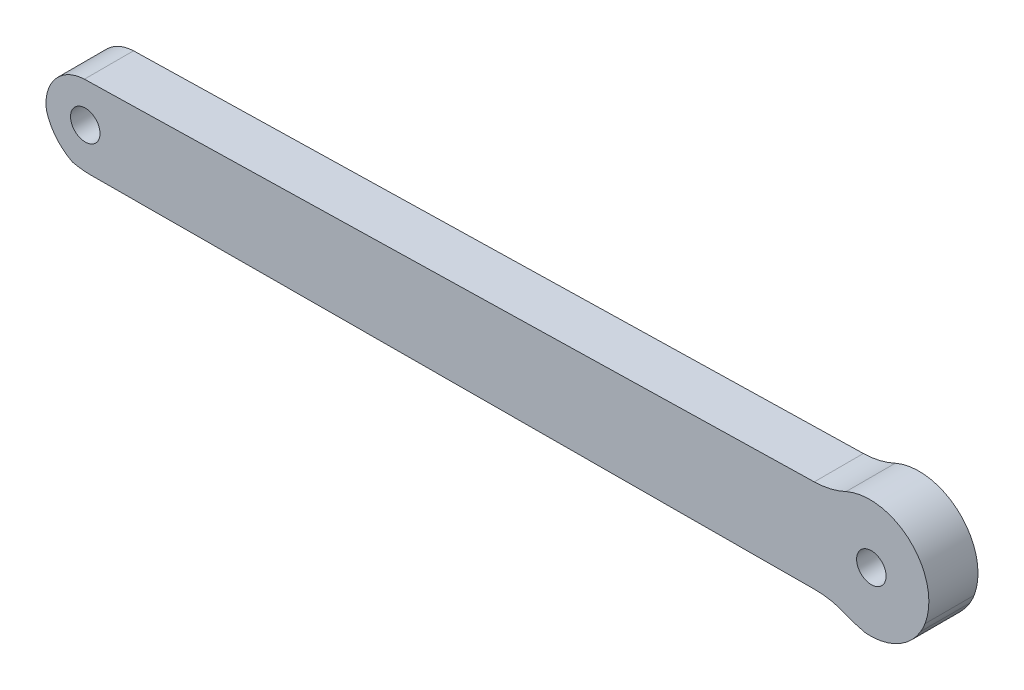
ISO-10303-21;
HEADER;
FILE_DESCRIPTION(('STEP AP214'),'2;1');
FILE_NAME('part.step','',(''),(''),'','','');
FILE_SCHEMA(('AUTOMOTIVE_DESIGN { 1 0 10303 214 1 1 1 1 }'));
ENDSEC;
DATA;
#1=APPLICATION_CONTEXT('core data for automotive mechanical design processes');
#2=APPLICATION_PROTOCOL_DEFINITION('international standard','automotive_design',2000,#1);
#3=PRODUCT_CONTEXT('',#1,'mechanical');
#4=PRODUCT('Part','Part','',(#3));
#5=PRODUCT_RELATED_PRODUCT_CATEGORY('part','',(#4));
#6=PRODUCT_DEFINITION_FORMATION('','',#4);
#7=PRODUCT_DEFINITION_CONTEXT('part definition',#1,'design');
#8=PRODUCT_DEFINITION('design','',#6,#7);
#9=PRODUCT_DEFINITION_SHAPE('','',#8);
#10=(LENGTH_UNIT() NAMED_UNIT(*) SI_UNIT(.MILLI.,.METRE.));
#11=(NAMED_UNIT(*) PLANE_ANGLE_UNIT() SI_UNIT($,.RADIAN.));
#12=(NAMED_UNIT(*) SI_UNIT($,.STERADIAN.) SOLID_ANGLE_UNIT());
#13=UNCERTAINTY_MEASURE_WITH_UNIT(LENGTH_MEASURE(1.E-05),#10,'distance_accuracy_value','');
#14=(GEOMETRIC_REPRESENTATION_CONTEXT(3) GLOBAL_UNCERTAINTY_ASSIGNED_CONTEXT((#13)) GLOBAL_UNIT_ASSIGNED_CONTEXT((#10,
#11,#12)) REPRESENTATION_CONTEXT('',''));
#15=CARTESIAN_POINT('',(0.,0.,0.));
#16=DIRECTION('',(0.,0.,1.));
#17=DIRECTION('',(1.,0.,0.));
#18=AXIS2_PLACEMENT_3D('',#15,#16,#17);
#19=CARTESIAN_POINT('',(2248.87555161224,1643.81417646837,5.));
#20=DIRECTION('',(0.,0.,1.));
#21=DIRECTION('',(1.,0.,0.));
#22=AXIS2_PLACEMENT_3D('',#19,#20,#21);
#23=PLANE('',#22);
#24=CARTESIAN_POINT('',(2168.21802948282,1642.92504021071,5.));
#25=DIRECTION('',(0.,0.,1.));
#26=DIRECTION('',(1.,0.,0.));
#27=AXIS2_PLACEMENT_3D('',#24,#25,#26);
#28=CIRCLE('',#27,1.50000000000011);
#29=CARTESIAN_POINT('',(2169.71802948282,1642.92504021071,5.));
#30=VERTEX_POINT('',#29);
#31=EDGE_CURVE('E176',#30,#30,#28,.T.);
#32=ORIENTED_EDGE('',*,*,#31,.F.);
#33=EDGE_LOOP('',(#32));
#34=FACE_BOUND('',#33,.T.);
#35=CARTESIAN_POINT('',(2248.87555161224,1643.81417646837,5.));
#36=DIRECTION('',(0.,0.,1.));
#37=DIRECTION('',(1.,0.,0.));
#38=AXIS2_PLACEMENT_3D('',#35,#36,#37);
#39=CIRCLE('',#38,6.07841978224706);
#40=CARTESIAN_POINT('',(2246.9678258357,1638.04288810175,5.));
#41=VERTEX_POINT('',#40);
#42=CARTESIAN_POINT('',(2247.65376621177,1637.85981441317,5.));
#43=VERTEX_POINT('',#42);
#44=EDGE_CURVE('E209',#41,#43,#39,.T.);
#45=ORIENTED_EDGE('',*,*,#44,.T.);
#46=CARTESIAN_POINT('',(2248.06658296509,1643.84586658425,5.));
#47=DIRECTION('',(0.,0.,1.));
#48=DIRECTION('',(1.,0.,0.));
#49=AXIS2_PLACEMENT_3D('',#46,#47,#48);
#50=CIRCLE('',#49,6.00026984948569);
#51=CARTESIAN_POINT('',(2253.23883895751,1640.80431990279,5.));
#52=VERTEX_POINT('',#51);
#53=EDGE_CURVE('E115',#43,#52,#50,.T.);
#54=ORIENTED_EDGE('',*,*,#53,.T.);
#55=CARTESIAN_POINT('',(2248.16682165628,1643.79766107637,5.));
#56=DIRECTION('',(0.,0.,1.));
#57=DIRECTION('',(1.,0.,0.));
#58=AXIS2_PLACEMENT_3D('',#55,#56,#57);
#59=CIRCLE('',#58,5.88943553198723);
#60=CARTESIAN_POINT('',(2253.67173298523,1641.70448116393,5.));
#61=VERTEX_POINT('',#60);
#62=EDGE_CURVE('E250',#52,#61,#59,.T.);
#63=ORIENTED_EDGE('',*,*,#62,.T.);
#64=CARTESIAN_POINT('',(2248.06658296509,1643.84586658425,5.));
#65=DIRECTION('',(0.,0.,1.));
#66=DIRECTION('',(1.,0.,0.));
#67=AXIS2_PLACEMENT_3D('',#64,#65,#66);
#68=CIRCLE('',#67,6.00026984948538);
#69=CARTESIAN_POINT('',(2245.64694396341,1649.33663933207,5.));
#70=VERTEX_POINT('',#69);
#71=EDGE_CURVE('E270',#61,#70,#68,.T.);
#72=ORIENTED_EDGE('',*,*,#71,.T.);
#73=CARTESIAN_POINT('',(2242.22674561174,1656.56911460103,5.));
#74=DIRECTION('',(0.,0.,-1.));
#75=DIRECTION('',(1.,0.,0.));
#76=AXIS2_PLACEMENT_3D('',#73,#74,#75);
#77=CIRCLE('',#76,8.00040344487991);
#78=CARTESIAN_POINT('',(2242.40432399022,1648.57068217959,5.));
#79=VERTEX_POINT('',#78);
#80=EDGE_CURVE('E266',#70,#79,#77,.T.);
#81=ORIENTED_EDGE('',*,*,#80,.T.);
#82=DIRECTION('',(-0.999754351339683,-0.0221638664806084,0.));
#83=VECTOR('',#82,1.);
#84=CARTESIAN_POINT('',(2242.40432399022,1648.57068217959,5.));
#85=LINE('',#84,#83);
#86=CARTESIAN_POINT('',(2168.12937401527,1646.92405761437,5.));
#87=VERTEX_POINT('',#86);
#88=EDGE_CURVE('E269',#79,#87,#85,.T.);
#89=ORIENTED_EDGE('',*,*,#88,.T.);
#90=CARTESIAN_POINT('',(2168.2985753185,1642.84723381647,5.));
#91=DIRECTION('',(0.,0.,1.));
#92=DIRECTION('',(1.,0.,0.));
#93=AXIS2_PLACEMENT_3D('',#90,#91,#92);
#94=CIRCLE('',#93,4.08033348639338);
#95=CARTESIAN_POINT('',(2164.26519110807,1642.2300359785,5.));
#96=VERTEX_POINT('',#95);
#97=EDGE_CURVE('E274',#87,#96,#94,.T.);
#98=ORIENTED_EDGE('',*,*,#97,.T.);
#99=CARTESIAN_POINT('',(2169.24904852874,1643.63290763037,5.));
#100=DIRECTION('',(0.,0.,1.));
#101=DIRECTION('',(1.,0.,0.));
#102=AXIS2_PLACEMENT_3D('',#99,#100,#101);
#103=CIRCLE('',#102,5.17753644711653);
#104=CARTESIAN_POINT('',(2166.93352039616,1639.00200997133,5.));
#105=VERTEX_POINT('',#104);
#106=EDGE_CURVE('E281',#96,#105,#103,.T.);
#107=ORIENTED_EDGE('',*,*,#106,.T.);
#108=CARTESIAN_POINT('',(2168.74214317514,1646.79552491601,5.));
#109=DIRECTION('',(0.,0.,1.));
#110=DIRECTION('',(1.,0.,0.));
#111=AXIS2_PLACEMENT_3D('',#108,#109,#110);
#112=CIRCLE('',#111,8.00062444747545);
#113=CARTESIAN_POINT('',(2168.77639322868,1638.79497377978,5.));
#114=VERTEX_POINT('',#113);
#115=EDGE_CURVE('E284',#105,#114,#112,.T.);
#116=ORIENTED_EDGE('',*,*,#115,.T.);
#117=DIRECTION('',(0.999990723069276,0.00430740935921032,0.));
#118=VECTOR('',#117,1.);
#119=CARTESIAN_POINT('',(2168.77639322868,1638.79497377978,5.));
#120=LINE('',#119,#118);
#121=CARTESIAN_POINT('',(2186.87080709587,1638.87291455048,5.));
#122=VERTEX_POINT('',#121);
#123=EDGE_CURVE('E149',#114,#122,#120,.T.);
#124=ORIENTED_EDGE('',*,*,#123,.T.);
#125=DIRECTION('',(0.99999074479343,0.00430236301141635,0.));
#126=VECTOR('',#125,1.);
#127=CARTESIAN_POINT('',(2186.87080709587,1638.87291455048,5.));
#128=LINE('',#127,#126);
#129=CARTESIAN_POINT('',(2242.52108602034,1639.11234446807,5.));
#130=VERTEX_POINT('',#129);
#131=EDGE_CURVE('E143',#122,#130,#128,.T.);
#132=ORIENTED_EDGE('',*,*,#131,.T.);
#133=CARTESIAN_POINT('',(2242.54158007553,1631.11407424039,5.));
#134=DIRECTION('',(0.,0.,-1.));
#135=DIRECTION('',(1.,0.,0.));
#136=AXIS2_PLACEMENT_3D('',#133,#134,#135);
#137=CIRCLE('',#136,7.99829648371076);
#138=CARTESIAN_POINT('',(2245.78158251303,1638.4267434416,5.));
#139=VERTEX_POINT('',#138);
#140=EDGE_CURVE('E147',#130,#139,#137,.T.);
#141=ORIENTED_EDGE('',*,*,#140,.T.);
#142=CARTESIAN_POINT('',(2248.21194548244,1643.91251517453,5.));
#143=DIRECTION('',(0.,0.,1.));
#144=DIRECTION('',(1.,0.,0.));
#145=AXIS2_PLACEMENT_3D('',#142,#143,#144);
#146=CIRCLE('',#145,6.00002963900537);
#147=EDGE_CURVE('E57',#139,#41,#146,.T.);
#148=ORIENTED_EDGE('',*,*,#147,.T.);
#149=EDGE_LOOP('',(#45,#54,#63,#72,#81,#89,#98,#107,#116,#124,#132,#141,#148));
#150=FACE_BOUND('',#149,.T.);
#151=CARTESIAN_POINT('',(2248.21189269629,1643.91255609579,5.));
#152=DIRECTION('',(0.,0.,1.));
#153=DIRECTION('',(1.,0.,0.));
#154=AXIS2_PLACEMENT_3D('',#151,#152,#153);
#155=CIRCLE('',#154,1.50000000000011);
#156=CARTESIAN_POINT('',(2249.71189269629,1643.91255609579,5.));
#157=VERTEX_POINT('',#156);
#158=EDGE_CURVE('E328',#157,#157,#155,.T.);
#159=ORIENTED_EDGE('',*,*,#158,.F.);
#160=EDGE_LOOP('',(#159));
#161=FACE_BOUND('',#160,.T.);
#162=ADVANCED_FACE('F39',(#34,#150,#161),#23,.T.);
#163=CARTESIAN_POINT('',(2248.87555161224,1643.81417646837,0.));
#164=DIRECTION('',(0.,0.,1.));
#165=DIRECTION('',(1.,0.,0.));
#166=AXIS2_PLACEMENT_3D('',#163,#164,#165);
#167=PLANE('',#166);
#168=CARTESIAN_POINT('',(2248.87555161224,1643.81417646837,0.));
#169=DIRECTION('',(0.,0.,1.));
#170=DIRECTION('',(1.,0.,0.));
#171=AXIS2_PLACEMENT_3D('',#168,#169,#170);
#172=CIRCLE('',#171,6.07841978224706);
#173=CARTESIAN_POINT('',(2246.9678258357,1638.04288810175,0.));
#174=VERTEX_POINT('',#173);
#175=CARTESIAN_POINT('',(2247.65376621177,1637.85981441317,0.));
#176=VERTEX_POINT('',#175);
#177=EDGE_CURVE('E171',#174,#176,#172,.T.);
#178=ORIENTED_EDGE('',*,*,#177,.F.);
#179=CARTESIAN_POINT('',(2248.21194548244,1643.91251517453,0.));
#180=DIRECTION('',(0.,0.,1.));
#181=DIRECTION('',(1.,0.,0.));
#182=AXIS2_PLACEMENT_3D('',#179,#180,#181);
#183=CIRCLE('',#182,6.00002963900537);
#184=CARTESIAN_POINT('',(2245.78158251303,1638.4267434416,0.));
#185=VERTEX_POINT('',#184);
#186=EDGE_CURVE('E107',#185,#174,#183,.T.);
#187=ORIENTED_EDGE('',*,*,#186,.F.);
#188=CARTESIAN_POINT('',(2242.54158007553,1631.11407424039,0.));
#189=DIRECTION('',(0.,0.,-1.));
#190=DIRECTION('',(1.,0.,0.));
#191=AXIS2_PLACEMENT_3D('',#188,#189,#190);
#192=CIRCLE('',#191,7.99829648371076);
#193=CARTESIAN_POINT('',(2242.52108602034,1639.11234446807,0.));
#194=VERTEX_POINT('',#193);
#195=EDGE_CURVE('E101',#194,#185,#192,.T.);
#196=ORIENTED_EDGE('',*,*,#195,.F.);
#197=DIRECTION('',(0.99999074479343,0.00430236301141635,0.));
#198=VECTOR('',#197,1.);
#199=CARTESIAN_POINT('',(2186.87080709587,1638.87291455048,0.));
#200=LINE('',#199,#198);
#201=CARTESIAN_POINT('',(2186.87080709587,1638.87291455048,0.));
#202=VERTEX_POINT('',#201);
#203=EDGE_CURVE('E158',#202,#194,#200,.T.);
#204=ORIENTED_EDGE('',*,*,#203,.F.);
#205=DIRECTION('',(0.999990723069276,0.00430740935921032,0.));
#206=VECTOR('',#205,1.);
#207=CARTESIAN_POINT('',(2168.77639322868,1638.79497377978,0.));
#208=LINE('',#207,#206);
#209=CARTESIAN_POINT('',(2168.77639322868,1638.79497377978,0.));
#210=VERTEX_POINT('',#209);
#211=EDGE_CURVE('E200',#210,#202,#208,.T.);
#212=ORIENTED_EDGE('',*,*,#211,.F.);
#213=CARTESIAN_POINT('',(2168.74214317514,1646.79552491601,0.));
#214=DIRECTION('',(0.,0.,1.));
#215=DIRECTION('',(1.,0.,0.));
#216=AXIS2_PLACEMENT_3D('',#213,#214,#215);
#217=CIRCLE('',#216,8.00062444747545);
#218=CARTESIAN_POINT('',(2166.93352039616,1639.00200997133,0.));
#219=VERTEX_POINT('',#218);
#220=EDGE_CURVE('E197',#219,#210,#217,.T.);
#221=ORIENTED_EDGE('',*,*,#220,.F.);
#222=CARTESIAN_POINT('',(2169.24904852874,1643.63290763037,0.));
#223=DIRECTION('',(0.,0.,1.));
#224=DIRECTION('',(1.,0.,0.));
#225=AXIS2_PLACEMENT_3D('',#222,#223,#224);
#226=CIRCLE('',#225,5.17753644711653);
#227=CARTESIAN_POINT('',(2164.26519110807,1642.2300359785,0.));
#228=VERTEX_POINT('',#227);
#229=EDGE_CURVE('E194',#228,#219,#226,.T.);
#230=ORIENTED_EDGE('',*,*,#229,.F.);
#231=CARTESIAN_POINT('',(2168.2985753185,1642.84723381647,0.));
#232=DIRECTION('',(0.,0.,1.));
#233=DIRECTION('',(1.,0.,0.));
#234=AXIS2_PLACEMENT_3D('',#231,#232,#233);
#235=CIRCLE('',#234,4.08033348639338);
#236=CARTESIAN_POINT('',(2168.12937401527,1646.92405761437,0.));
#237=VERTEX_POINT('',#236);
#238=EDGE_CURVE('E191',#237,#228,#235,.T.);
#239=ORIENTED_EDGE('',*,*,#238,.F.);
#240=DIRECTION('',(-0.999754351339683,-0.0221638664806084,0.));
#241=VECTOR('',#240,1.);
#242=CARTESIAN_POINT('',(2242.40432399022,1648.57068217959,0.));
#243=LINE('',#242,#241);
#244=CARTESIAN_POINT('',(2242.40432399022,1648.57068217959,0.));
#245=VERTEX_POINT('',#244);
#246=EDGE_CURVE('E188',#245,#237,#243,.T.);
#247=ORIENTED_EDGE('',*,*,#246,.F.);
#248=CARTESIAN_POINT('',(2242.22674561174,1656.56911460103,0.));
#249=DIRECTION('',(0.,0.,-1.));
#250=DIRECTION('',(1.,0.,0.));
#251=AXIS2_PLACEMENT_3D('',#248,#249,#250);
#252=CIRCLE('',#251,8.00040344487991);
#253=CARTESIAN_POINT('',(2245.64694396341,1649.33663933207,0.));
#254=VERTEX_POINT('',#253);
#255=EDGE_CURVE('E185',#254,#245,#252,.T.);
#256=ORIENTED_EDGE('',*,*,#255,.F.);
#257=CARTESIAN_POINT('',(2248.06658296509,1643.84586658425,0.));
#258=DIRECTION('',(0.,0.,1.));
#259=DIRECTION('',(1.,0.,0.));
#260=AXIS2_PLACEMENT_3D('',#257,#258,#259);
#261=CIRCLE('',#260,6.00026984948538);
#262=CARTESIAN_POINT('',(2253.67173298523,1641.70448116393,0.));
#263=VERTEX_POINT('',#262);
#264=EDGE_CURVE('E182',#263,#254,#261,.T.);
#265=ORIENTED_EDGE('',*,*,#264,.F.);
#266=CARTESIAN_POINT('',(2248.16682165628,1643.79766107637,0.));
#267=DIRECTION('',(0.,0.,1.));
#268=DIRECTION('',(1.,0.,0.));
#269=AXIS2_PLACEMENT_3D('',#266,#267,#268);
#270=CIRCLE('',#269,5.88943553198723);
#271=CARTESIAN_POINT('',(2253.23883895751,1640.80431990279,0.));
#272=VERTEX_POINT('',#271);
#273=EDGE_CURVE('E179',#272,#263,#270,.T.);
#274=ORIENTED_EDGE('',*,*,#273,.F.);
#275=CARTESIAN_POINT('',(2248.06658296509,1643.84586658425,0.));
#276=DIRECTION('',(0.,0.,1.));
#277=DIRECTION('',(1.,0.,0.));
#278=AXIS2_PLACEMENT_3D('',#275,#276,#277);
#279=CIRCLE('',#278,6.00026984948569);
#280=EDGE_CURVE('E175',#176,#272,#279,.T.);
#281=ORIENTED_EDGE('',*,*,#280,.F.);
#282=EDGE_LOOP('',(#178,#187,#196,#204,#212,#221,#230,#239,#247,#256,#265,#274,#281));
#283=FACE_BOUND('',#282,.T.);
#284=CARTESIAN_POINT('',(2168.21802948282,1642.92504021071,0.));
#285=DIRECTION('',(0.,0.,1.));
#286=DIRECTION('',(1.,0.,0.));
#287=AXIS2_PLACEMENT_3D('',#284,#285,#286);
#288=CIRCLE('',#287,1.50000000000011);
#289=CARTESIAN_POINT('',(2169.71802948282,1642.92504021071,0.));
#290=VERTEX_POINT('',#289);
#291=EDGE_CURVE('E336',#290,#290,#288,.T.);
#292=ORIENTED_EDGE('',*,*,#291,.T.);
#293=EDGE_LOOP('',(#292));
#294=FACE_BOUND('',#293,.T.);
#295=CARTESIAN_POINT('',(2248.21189269629,1643.91255609579,0.));
#296=DIRECTION('',(0.,0.,1.));
#297=DIRECTION('',(1.,0.,0.));
#298=AXIS2_PLACEMENT_3D('',#295,#296,#297);
#299=CIRCLE('',#298,1.50000000000011);
#300=CARTESIAN_POINT('',(2249.71189269629,1643.91255609579,0.));
#301=VERTEX_POINT('',#300);
#302=EDGE_CURVE('E331',#301,#301,#299,.T.);
#303=ORIENTED_EDGE('',*,*,#302,.T.);
#304=EDGE_LOOP('',(#303));
#305=FACE_BOUND('',#304,.T.);
#306=ADVANCED_FACE('F254',(#283,#294,#305),#167,.F.);
#307=CARTESIAN_POINT('',(2248.87555161224,1643.81417646837,5.));
#308=DIRECTION('',(0.,0.,-1.));
#309=DIRECTION('',(-1.,0.,0.));
#310=AXIS2_PLACEMENT_3D('',#307,#308,#309);
#311=CYLINDRICAL_SURFACE('',#310,6.07841978224706);
#312=ORIENTED_EDGE('',*,*,#177,.T.);
#313=DIRECTION('',(0.,0.,-1.));
#314=VECTOR('',#313,1.);
#315=CARTESIAN_POINT('',(2247.65376621177,1637.85981441317,5.));
#316=LINE('',#315,#314);
#317=EDGE_CURVE('E11',#43,#176,#316,.T.);
#318=ORIENTED_EDGE('',*,*,#317,.F.);
#319=ORIENTED_EDGE('',*,*,#44,.F.);
#320=DIRECTION('',(0.,0.,-1.));
#321=VECTOR('',#320,1.);
#322=CARTESIAN_POINT('',(2246.9678258357,1638.04288810175,5.));
#323=LINE('',#322,#321);
#324=EDGE_CURVE('E167',#41,#174,#323,.T.);
#325=ORIENTED_EDGE('',*,*,#324,.T.);
#326=EDGE_LOOP('',(#312,#318,#319,#325));
#327=FACE_BOUND('',#326,.T.);
#328=ADVANCED_FACE('F41',(#327),#311,.T.);
#329=CARTESIAN_POINT('',(2248.06658296509,1643.84586658425,5.));
#330=DIRECTION('',(0.,0.,-1.));
#331=DIRECTION('',(-1.,0.,0.));
#332=AXIS2_PLACEMENT_3D('',#329,#330,#331);
#333=CYLINDRICAL_SURFACE('',#332,6.00026984948569);
#334=ORIENTED_EDGE('',*,*,#280,.T.);
#335=DIRECTION('',(0.,0.,-1.));
#336=VECTOR('',#335,1.);
#337=CARTESIAN_POINT('',(2253.23883895751,1640.80431990279,5.));
#338=LINE('',#337,#336);
#339=EDGE_CURVE('E49',#52,#272,#338,.T.);
#340=ORIENTED_EDGE('',*,*,#339,.F.);
#341=ORIENTED_EDGE('',*,*,#53,.F.);
#342=ORIENTED_EDGE('',*,*,#317,.T.);
#343=EDGE_LOOP('',(#334,#340,#341,#342));
#344=FACE_BOUND('',#343,.T.);
#345=ADVANCED_FACE('F444',(#344),#333,.T.);
#346=CARTESIAN_POINT('',(2248.16682165628,1643.79766107637,5.));
#347=DIRECTION('',(0.,0.,-1.));
#348=DIRECTION('',(-1.,0.,0.));
#349=AXIS2_PLACEMENT_3D('',#346,#347,#348);
#350=CYLINDRICAL_SURFACE('',#349,5.88943553198723);
#351=ORIENTED_EDGE('',*,*,#273,.T.);
#352=DIRECTION('',(0.,0.,-1.));
#353=VECTOR('',#352,1.);
#354=CARTESIAN_POINT('',(2253.67173298523,1641.70448116393,5.));
#355=LINE('',#354,#353);
#356=EDGE_CURVE('E240',#61,#263,#355,.T.);
#357=ORIENTED_EDGE('',*,*,#356,.F.);
#358=ORIENTED_EDGE('',*,*,#62,.F.);
#359=ORIENTED_EDGE('',*,*,#339,.T.);
#360=EDGE_LOOP('',(#351,#357,#358,#359));
#361=FACE_BOUND('',#360,.T.);
#362=ADVANCED_FACE('F248',(#361),#350,.T.);
#363=CARTESIAN_POINT('',(2248.06658296509,1643.84586658425,5.));
#364=DIRECTION('',(0.,0.,-1.));
#365=DIRECTION('',(-1.,0.,0.));
#366=AXIS2_PLACEMENT_3D('',#363,#364,#365);
#367=CYLINDRICAL_SURFACE('',#366,6.00026984948538);
#368=ORIENTED_EDGE('',*,*,#264,.T.);
#369=DIRECTION('',(0.,0.,-1.));
#370=VECTOR('',#369,1.);
#371=CARTESIAN_POINT('',(2245.64694396341,1649.33663933207,5.));
#372=LINE('',#371,#370);
#373=EDGE_CURVE('E236',#70,#254,#372,.T.);
#374=ORIENTED_EDGE('',*,*,#373,.F.);
#375=ORIENTED_EDGE('',*,*,#71,.F.);
#376=ORIENTED_EDGE('',*,*,#356,.T.);
#377=EDGE_LOOP('',(#368,#374,#375,#376));
#378=FACE_BOUND('',#377,.T.);
#379=ADVANCED_FACE('F260',(#378),#367,.T.);
#380=CARTESIAN_POINT('',(2242.22674561174,1656.56911460103,5.));
#381=DIRECTION('',(0.,0.,-1.));
#382=DIRECTION('',(-1.,0.,0.));
#383=AXIS2_PLACEMENT_3D('',#380,#381,#382);
#384=CYLINDRICAL_SURFACE('',#383,8.00040344487991);
#385=ORIENTED_EDGE('',*,*,#255,.T.);
#386=DIRECTION('',(0.,0.,-1.));
#387=VECTOR('',#386,1.);
#388=CARTESIAN_POINT('',(2242.40432399022,1648.57068217959,5.));
#389=LINE('',#388,#387);
#390=EDGE_CURVE('E232',#79,#245,#389,.T.);
#391=ORIENTED_EDGE('',*,*,#390,.F.);
#392=ORIENTED_EDGE('',*,*,#80,.F.);
#393=ORIENTED_EDGE('',*,*,#373,.T.);
#394=EDGE_LOOP('',(#385,#391,#392,#393));
#395=FACE_BOUND('',#394,.T.);
#396=ADVANCED_FACE('F264',(#395),#384,.F.);
#397=CARTESIAN_POINT('',(2242.40432399022,1648.57068217959,5.));
#398=DIRECTION('',(0.0221638664806084,-0.999754351339683,0.));
#399=DIRECTION('',(0.999754351339683,0.0221638664806084,0.));
#400=AXIS2_PLACEMENT_3D('',#397,#398,#399);
#401=PLANE('',#400);
#402=ORIENTED_EDGE('',*,*,#246,.T.);
#403=DIRECTION('',(0.,0.,-1.));
#404=VECTOR('',#403,1.);
#405=CARTESIAN_POINT('',(2168.12937401527,1646.92405761437,5.));
#406=LINE('',#405,#404);
#407=EDGE_CURVE('E228',#87,#237,#406,.T.);
#408=ORIENTED_EDGE('',*,*,#407,.F.);
#409=ORIENTED_EDGE('',*,*,#88,.F.);
#410=ORIENTED_EDGE('',*,*,#390,.T.);
#411=EDGE_LOOP('',(#402,#408,#409,#410));
#412=FACE_BOUND('',#411,.T.);
#413=ADVANCED_FACE('F409',(#412),#401,.F.);
#414=CARTESIAN_POINT('',(2168.2985753185,1642.84723381647,5.));
#415=DIRECTION('',(0.,0.,-1.));
#416=DIRECTION('',(-1.,0.,0.));
#417=AXIS2_PLACEMENT_3D('',#414,#415,#416);
#418=CYLINDRICAL_SURFACE('',#417,4.08033348639338);
#419=ORIENTED_EDGE('',*,*,#238,.T.);
#420=DIRECTION('',(0.,0.,-1.));
#421=VECTOR('',#420,1.);
#422=CARTESIAN_POINT('',(2164.26519110807,1642.2300359785,5.));
#423=LINE('',#422,#421);
#424=EDGE_CURVE('E224',#96,#228,#423,.T.);
#425=ORIENTED_EDGE('',*,*,#424,.F.);
#426=ORIENTED_EDGE('',*,*,#97,.F.);
#427=ORIENTED_EDGE('',*,*,#407,.T.);
#428=EDGE_LOOP('',(#419,#425,#426,#427));
#429=FACE_BOUND('',#428,.T.);
#430=ADVANCED_FACE('F399',(#429),#418,.T.);
#431=CARTESIAN_POINT('',(2169.24904852874,1643.63290763037,5.));
#432=DIRECTION('',(0.,0.,-1.));
#433=DIRECTION('',(-1.,0.,0.));
#434=AXIS2_PLACEMENT_3D('',#431,#432,#433);
#435=CYLINDRICAL_SURFACE('',#434,5.17753644711653);
#436=ORIENTED_EDGE('',*,*,#229,.T.);
#437=DIRECTION('',(0.,0.,-1.));
#438=VECTOR('',#437,1.);
#439=CARTESIAN_POINT('',(2166.93352039616,1639.00200997133,5.));
#440=LINE('',#439,#438);
#441=EDGE_CURVE('E220',#105,#219,#440,.T.);
#442=ORIENTED_EDGE('',*,*,#441,.F.);
#443=ORIENTED_EDGE('',*,*,#106,.F.);
#444=ORIENTED_EDGE('',*,*,#424,.T.);
#445=EDGE_LOOP('',(#436,#442,#443,#444));
#446=FACE_BOUND('',#445,.T.);
#447=ADVANCED_FACE('F390',(#446),#435,.T.);
#448=CARTESIAN_POINT('',(2168.74214317514,1646.79552491601,5.));
#449=DIRECTION('',(0.,0.,-1.));
#450=DIRECTION('',(-1.,0.,0.));
#451=AXIS2_PLACEMENT_3D('',#448,#449,#450);
#452=CYLINDRICAL_SURFACE('',#451,8.00062444747545);
#453=ORIENTED_EDGE('',*,*,#220,.T.);
#454=DIRECTION('',(0.,0.,-1.));
#455=VECTOR('',#454,1.);
#456=CARTESIAN_POINT('',(2168.77639322868,1638.79497377978,5.));
#457=LINE('',#456,#455);
#458=EDGE_CURVE('E216',#114,#210,#457,.T.);
#459=ORIENTED_EDGE('',*,*,#458,.F.);
#460=ORIENTED_EDGE('',*,*,#115,.F.);
#461=ORIENTED_EDGE('',*,*,#441,.T.);
#462=EDGE_LOOP('',(#453,#459,#460,#461));
#463=FACE_BOUND('',#462,.T.);
#464=ADVANCED_FACE('F292',(#463),#452,.T.);
#465=CARTESIAN_POINT('',(2168.77639322868,1638.79497377978,5.));
#466=DIRECTION('',(-0.00430740935921032,0.999990723069275,0.));
#467=DIRECTION('',(-0.999990723069275,-0.00430740935921032,0.));
#468=AXIS2_PLACEMENT_3D('',#465,#466,#467);
#469=PLANE('',#468);
#470=ORIENTED_EDGE('',*,*,#211,.T.);
#471=DIRECTION('',(0.,0.,-1.));
#472=VECTOR('',#471,1.);
#473=CARTESIAN_POINT('',(2186.87080709587,1638.87291455048,5.));
#474=LINE('',#473,#472);
#475=EDGE_CURVE('E160',#122,#202,#474,.T.);
#476=ORIENTED_EDGE('',*,*,#475,.F.);
#477=ORIENTED_EDGE('',*,*,#123,.F.);
#478=ORIENTED_EDGE('',*,*,#458,.T.);
#479=EDGE_LOOP('',(#470,#476,#477,#478));
#480=FACE_BOUND('',#479,.T.);
#481=ADVANCED_FACE('F296',(#480),#469,.F.);
#482=CARTESIAN_POINT('',(2186.87080709587,1638.87291455048,5.));
#483=DIRECTION('',(-0.00430236301141635,0.99999074479343,0.));
#484=DIRECTION('',(-0.99999074479343,-0.00430236301141635,0.));
#485=AXIS2_PLACEMENT_3D('',#482,#483,#484);
#486=PLANE('',#485);
#487=ORIENTED_EDGE('',*,*,#203,.T.);
#488=DIRECTION('',(0.,0.,-1.));
#489=VECTOR('',#488,1.);
#490=CARTESIAN_POINT('',(2242.52108602034,1639.11234446807,5.));
#491=LINE('',#490,#489);
#492=EDGE_CURVE('E155',#130,#194,#491,.T.);
#493=ORIENTED_EDGE('',*,*,#492,.F.);
#494=ORIENTED_EDGE('',*,*,#131,.F.);
#495=ORIENTED_EDGE('',*,*,#475,.T.);
#496=EDGE_LOOP('',(#487,#493,#494,#495));
#497=FACE_BOUND('',#496,.T.);
#498=ADVANCED_FACE('F156',(#497),#486,.F.);
#499=CARTESIAN_POINT('',(2242.54158007553,1631.11407424039,5.));
#500=DIRECTION('',(0.,0.,-1.));
#501=DIRECTION('',(-1.,0.,0.));
#502=AXIS2_PLACEMENT_3D('',#499,#500,#501);
#503=CYLINDRICAL_SURFACE('',#502,7.99829648371076);
#504=ORIENTED_EDGE('',*,*,#195,.T.);
#505=DIRECTION('',(0.,0.,-1.));
#506=VECTOR('',#505,1.);
#507=CARTESIAN_POINT('',(2245.78158251303,1638.4267434416,5.));
#508=LINE('',#507,#506);
#509=EDGE_CURVE('E161',#139,#185,#508,.T.);
#510=ORIENTED_EDGE('',*,*,#509,.F.);
#511=ORIENTED_EDGE('',*,*,#140,.F.);
#512=ORIENTED_EDGE('',*,*,#492,.T.);
#513=EDGE_LOOP('',(#504,#510,#511,#512));
#514=FACE_BOUND('',#513,.T.);
#515=ADVANCED_FACE('F163',(#514),#503,.F.);
#516=CARTESIAN_POINT('',(2248.21194548244,1643.91251517453,5.));
#517=DIRECTION('',(0.,0.,-1.));
#518=DIRECTION('',(-1.,0.,0.));
#519=AXIS2_PLACEMENT_3D('',#516,#517,#518);
#520=CYLINDRICAL_SURFACE('',#519,6.00002963900537);
#521=ORIENTED_EDGE('',*,*,#186,.T.);
#522=ORIENTED_EDGE('',*,*,#324,.F.);
#523=ORIENTED_EDGE('',*,*,#147,.F.);
#524=ORIENTED_EDGE('',*,*,#509,.T.);
#525=EDGE_LOOP('',(#521,#522,#523,#524));
#526=FACE_BOUND('',#525,.T.);
#527=ADVANCED_FACE('F300',(#526),#520,.T.);
#528=CARTESIAN_POINT('',(2168.21802948282,1642.92504021071,5.));
#529=DIRECTION('',(0.,0.,-1.));
#530=DIRECTION('',(-1.,0.,0.));
#531=AXIS2_PLACEMENT_3D('',#528,#529,#530);
#532=CYLINDRICAL_SURFACE('',#531,1.50000000000011);
#533=ORIENTED_EDGE('',*,*,#31,.T.);
#534=EDGE_LOOP('',(#533));
#535=FACE_BOUND('',#534,.T.);
#536=ORIENTED_EDGE('',*,*,#291,.F.);
#537=EDGE_LOOP('',(#536));
#538=FACE_BOUND('',#537,.T.);
#539=ADVANCED_FACE('F302',(#535,#538),#532,.F.);
#540=CARTESIAN_POINT('',(2248.21189269629,1643.91255609579,5.));
#541=DIRECTION('',(0.,0.,-1.));
#542=DIRECTION('',(-1.,0.,0.));
#543=AXIS2_PLACEMENT_3D('',#540,#541,#542);
#544=CYLINDRICAL_SURFACE('',#543,1.50000000000011);
#545=ORIENTED_EDGE('',*,*,#158,.T.);
#546=EDGE_LOOP('',(#545));
#547=FACE_BOUND('',#546,.T.);
#548=ORIENTED_EDGE('',*,*,#302,.F.);
#549=EDGE_LOOP('',(#548));
#550=FACE_BOUND('',#549,.T.);
#551=ADVANCED_FACE('F308',(#547,#550),#544,.F.);
#552=CLOSED_SHELL('',(#162,#306,#328,#345,#362,#379,#396,#413,#430,#447,#464,#481,#498,#515,
#527,#539,#551));
#553=MANIFOLD_SOLID_BREP('B2',#552);
#554=ADVANCED_BREP_SHAPE_REPRESENTATION('',(#18,#553),#14);
#555=SHAPE_DEFINITION_REPRESENTATION(#9,#554);
ENDSEC;
END-ISO-10303-21;
